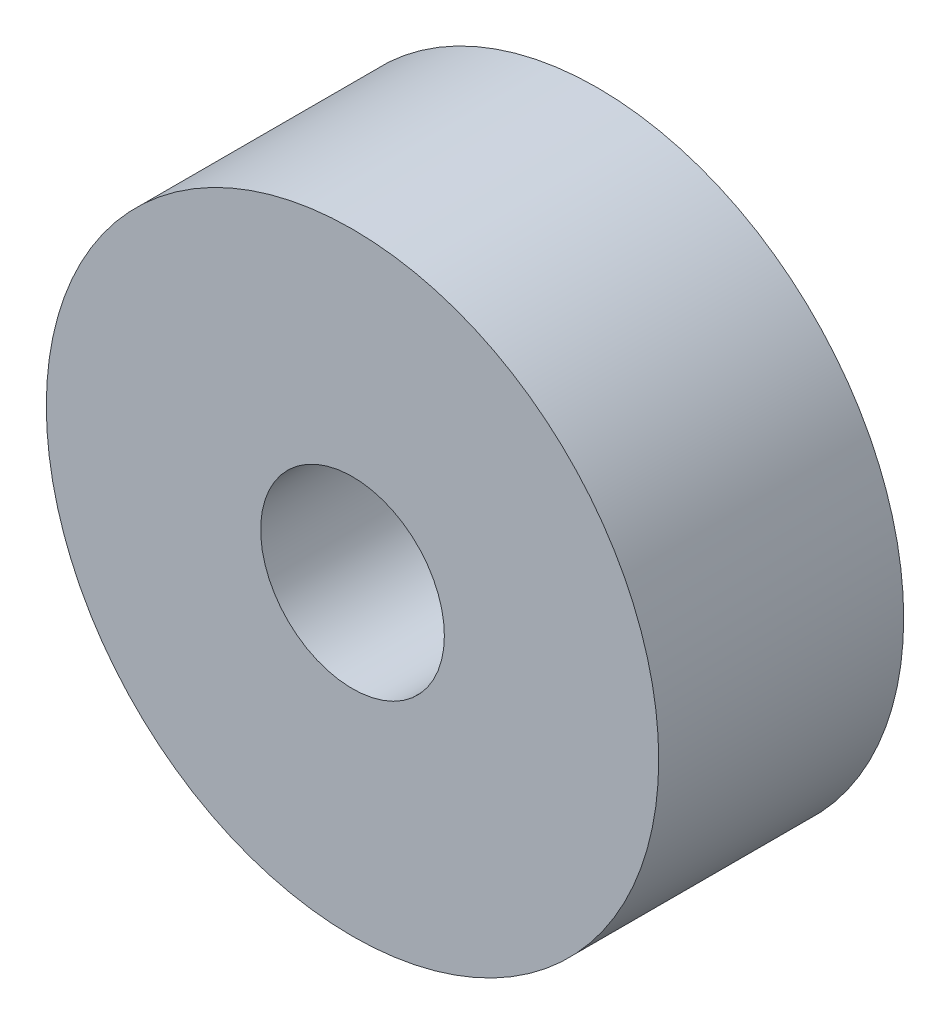
ISO-10303-21;
HEADER;
FILE_DESCRIPTION(('STEP AP214'),'2;1');
FILE_NAME('part.step','',(''),(''),'','','');
FILE_SCHEMA(('AUTOMOTIVE_DESIGN { 1 0 10303 214 1 1 1 1 }'));
ENDSEC;
DATA;
#1=APPLICATION_CONTEXT('core data for automotive mechanical design processes');
#2=APPLICATION_PROTOCOL_DEFINITION('international standard','automotive_design',2000,#1);
#3=PRODUCT_CONTEXT('',#1,'mechanical');
#4=PRODUCT('Part','Part','',(#3));
#5=PRODUCT_RELATED_PRODUCT_CATEGORY('part','',(#4));
#6=PRODUCT_DEFINITION_FORMATION('','',#4);
#7=PRODUCT_DEFINITION_CONTEXT('part definition',#1,'design');
#8=PRODUCT_DEFINITION('design','',#6,#7);
#9=PRODUCT_DEFINITION_SHAPE('','',#8);
#10=(LENGTH_UNIT() NAMED_UNIT(*) SI_UNIT(.MILLI.,.METRE.));
#11=(NAMED_UNIT(*) PLANE_ANGLE_UNIT() SI_UNIT($,.RADIAN.));
#12=(NAMED_UNIT(*) SI_UNIT($,.STERADIAN.) SOLID_ANGLE_UNIT());
#13=UNCERTAINTY_MEASURE_WITH_UNIT(LENGTH_MEASURE(1.E-05),#10,'distance_accuracy_value','');
#14=(GEOMETRIC_REPRESENTATION_CONTEXT(3) GLOBAL_UNCERTAINTY_ASSIGNED_CONTEXT((#13)) GLOBAL_UNIT_ASSIGNED_CONTEXT((#10,
#11,#12)) REPRESENTATION_CONTEXT('',''));
#15=CARTESIAN_POINT('',(0.,0.,0.));
#16=DIRECTION('',(0.,0.,1.));
#17=DIRECTION('',(1.,0.,0.));
#18=AXIS2_PLACEMENT_3D('',#15,#16,#17);
#19=CARTESIAN_POINT('',(0.,0.,4.));
#20=DIRECTION('',(0.,0.,1.));
#21=DIRECTION('',(1.,0.,0.));
#22=AXIS2_PLACEMENT_3D('',#19,#20,#21);
#23=PLANE('',#22);
#24=CARTESIAN_POINT('',(0.,0.,4.));
#25=DIRECTION('',(0.,0.,1.));
#26=DIRECTION('',(1.,0.,0.));
#27=AXIS2_PLACEMENT_3D('',#24,#25,#26);
#28=CIRCLE('',#27,5.);
#29=CARTESIAN_POINT('',(5.,0.,4.));
#30=VERTEX_POINT('',#29);
#31=EDGE_CURVE('E10',#30,#30,#28,.T.);
#32=ORIENTED_EDGE('',*,*,#31,.T.);
#33=EDGE_LOOP('',(#32));
#34=FACE_BOUND('',#33,.T.);
#35=CARTESIAN_POINT('',(0.,0.,4.));
#36=DIRECTION('',(0.,0.,1.));
#37=DIRECTION('',(1.,0.,0.));
#38=AXIS2_PLACEMENT_3D('',#35,#36,#37);
#39=CIRCLE('',#38,1.5);
#40=CARTESIAN_POINT('',(1.5,0.,4.));
#41=VERTEX_POINT('',#40);
#42=EDGE_CURVE('E42',#41,#41,#39,.T.);
#43=ORIENTED_EDGE('',*,*,#42,.F.);
#44=EDGE_LOOP('',(#43));
#45=FACE_BOUND('',#44,.T.);
#46=ADVANCED_FACE('F31',(#34,#45),#23,.T.);
#47=CARTESIAN_POINT('',(0.,0.,0.));
#48=DIRECTION('',(0.,0.,1.));
#49=DIRECTION('',(1.,0.,0.));
#50=AXIS2_PLACEMENT_3D('',#47,#48,#49);
#51=PLANE('',#50);
#52=CARTESIAN_POINT('',(0.,0.,0.));
#53=DIRECTION('',(0.,0.,1.));
#54=DIRECTION('',(1.,0.,0.));
#55=AXIS2_PLACEMENT_3D('',#52,#53,#54);
#56=CIRCLE('',#55,5.);
#57=CARTESIAN_POINT('',(5.,0.,0.));
#58=VERTEX_POINT('',#57);
#59=EDGE_CURVE('E35',#58,#58,#56,.T.);
#60=ORIENTED_EDGE('',*,*,#59,.F.);
#61=EDGE_LOOP('',(#60));
#62=FACE_BOUND('',#61,.T.);
#63=CARTESIAN_POINT('',(0.,0.,0.));
#64=DIRECTION('',(0.,0.,1.));
#65=DIRECTION('',(1.,0.,0.));
#66=AXIS2_PLACEMENT_3D('',#63,#64,#65);
#67=CIRCLE('',#66,1.5);
#68=CARTESIAN_POINT('',(1.5,0.,0.));
#69=VERTEX_POINT('',#68);
#70=EDGE_CURVE('E44',#69,#69,#67,.T.);
#71=ORIENTED_EDGE('',*,*,#70,.T.);
#72=EDGE_LOOP('',(#71));
#73=FACE_BOUND('',#72,.T.);
#74=ADVANCED_FACE('F54',(#62,#73),#51,.F.);
#75=CARTESIAN_POINT('',(0.,0.,4.));
#76=DIRECTION('',(0.,0.,-1.));
#77=DIRECTION('',(-1.,0.,0.));
#78=AXIS2_PLACEMENT_3D('',#75,#76,#77);
#79=CYLINDRICAL_SURFACE('',#78,5.);
#80=ORIENTED_EDGE('',*,*,#31,.F.);
#81=EDGE_LOOP('',(#80));
#82=FACE_BOUND('',#81,.T.);
#83=ORIENTED_EDGE('',*,*,#59,.T.);
#84=EDGE_LOOP('',(#83));
#85=FACE_BOUND('',#84,.T.);
#86=ADVANCED_FACE('F33',(#82,#85),#79,.T.);
#87=CARTESIAN_POINT('',(0.,0.,4.));
#88=DIRECTION('',(0.,0.,-1.));
#89=DIRECTION('',(-1.,0.,0.));
#90=AXIS2_PLACEMENT_3D('',#87,#88,#89);
#91=CYLINDRICAL_SURFACE('',#90,1.5);
#92=ORIENTED_EDGE('',*,*,#42,.T.);
#93=EDGE_LOOP('',(#92));
#94=FACE_BOUND('',#93,.T.);
#95=ORIENTED_EDGE('',*,*,#70,.F.);
#96=EDGE_LOOP('',(#95));
#97=FACE_BOUND('',#96,.T.);
#98=ADVANCED_FACE('F50',(#94,#97),#91,.F.);
#99=CLOSED_SHELL('',(#46,#74,#86,#98));
#100=MANIFOLD_SOLID_BREP('B2',#99);
#101=ADVANCED_BREP_SHAPE_REPRESENTATION('',(#18,#100),#14);
#102=SHAPE_DEFINITION_REPRESENTATION(#9,#101);
ENDSEC;
END-ISO-10303-21;
